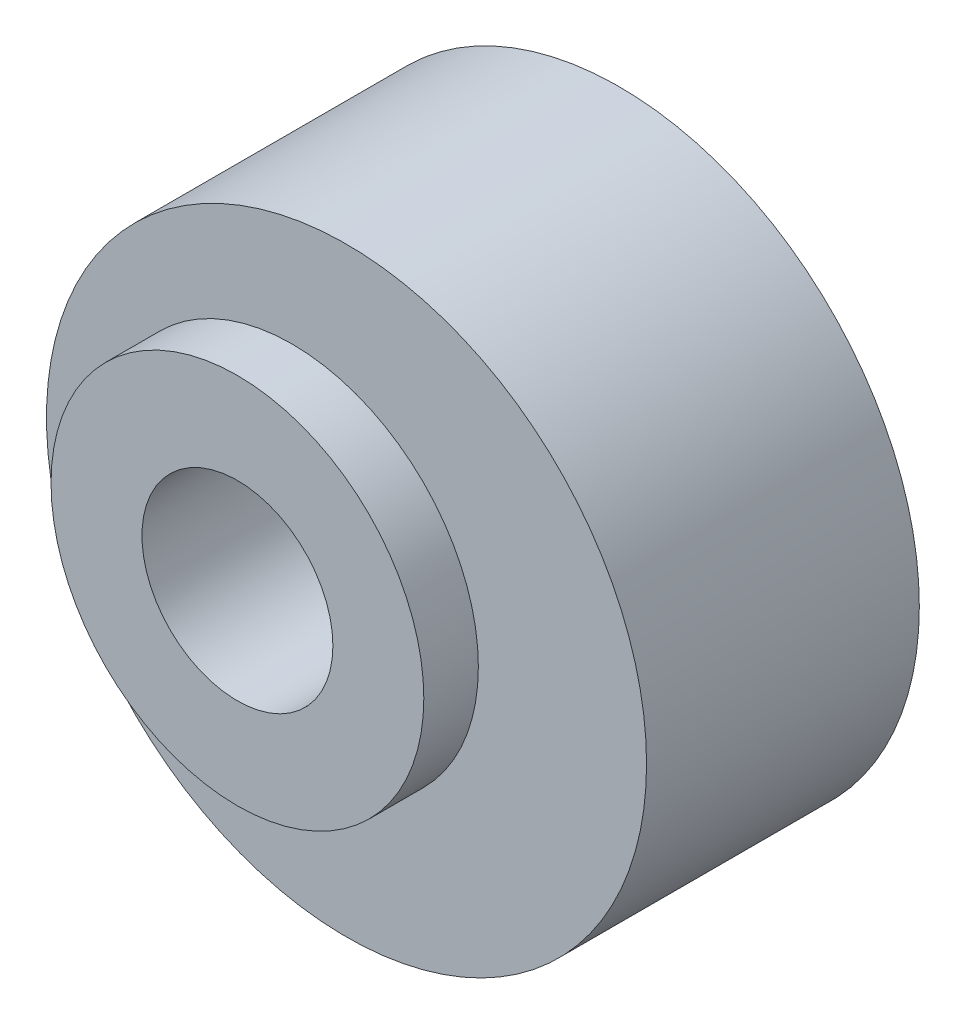
ISO-10303-21;
HEADER;
FILE_DESCRIPTION(('STEP AP214'),'2;1');
FILE_NAME('part.step','',(''),(''),'','','');
FILE_SCHEMA(('AUTOMOTIVE_DESIGN { 1 0 10303 214 1 1 1 1 }'));
ENDSEC;
DATA;
#1=APPLICATION_CONTEXT('core data for automotive mechanical design processes');
#2=APPLICATION_PROTOCOL_DEFINITION('international standard','automotive_design',2000,#1);
#3=PRODUCT_CONTEXT('',#1,'mechanical');
#4=PRODUCT('Part','Part','',(#3));
#5=PRODUCT_RELATED_PRODUCT_CATEGORY('part','',(#4));
#6=PRODUCT_DEFINITION_FORMATION('','',#4);
#7=PRODUCT_DEFINITION_CONTEXT('part definition',#1,'design');
#8=PRODUCT_DEFINITION('design','',#6,#7);
#9=PRODUCT_DEFINITION_SHAPE('','',#8);
#10=(LENGTH_UNIT() NAMED_UNIT(*) SI_UNIT(.MILLI.,.METRE.));
#11=(NAMED_UNIT(*) PLANE_ANGLE_UNIT() SI_UNIT($,.RADIAN.));
#12=(NAMED_UNIT(*) SI_UNIT($,.STERADIAN.) SOLID_ANGLE_UNIT());
#13=UNCERTAINTY_MEASURE_WITH_UNIT(LENGTH_MEASURE(1.E-05),#10,'distance_accuracy_value','');
#14=(GEOMETRIC_REPRESENTATION_CONTEXT(3) GLOBAL_UNCERTAINTY_ASSIGNED_CONTEXT((#13)) GLOBAL_UNIT_ASSIGNED_CONTEXT((#10,
#11,#12)) REPRESENTATION_CONTEXT('',''));
#15=CARTESIAN_POINT('',(0.,0.,0.));
#16=DIRECTION('',(0.,0.,1.));
#17=DIRECTION('',(1.,0.,0.));
#18=AXIS2_PLACEMENT_3D('',#15,#16,#17);
#19=CARTESIAN_POINT('',(-1.,0.,6.));
#20=DIRECTION('',(0.,0.,1.));
#21=DIRECTION('',(1.,0.,0.));
#22=AXIS2_PLACEMENT_3D('',#19,#20,#21);
#23=PLANE('',#22);
#24=CARTESIAN_POINT('',(-1.,0.,6.));
#25=DIRECTION('',(0.,0.,1.));
#26=DIRECTION('',(1.,0.,0.));
#27=AXIS2_PLACEMENT_3D('',#24,#25,#26);
#28=CIRCLE('',#27,1.75);
#29=CARTESIAN_POINT('',(0.75,0.,6.));
#30=VERTEX_POINT('',#29);
#31=EDGE_CURVE('E38',#30,#30,#28,.F.);
#32=ORIENTED_EDGE('',*,*,#31,.T.);
#33=EDGE_LOOP('',(#32));
#34=FACE_BOUND('',#33,.T.);
#35=CARTESIAN_POINT('',(-1.,0.,6.));
#36=DIRECTION('',(0.,0.,1.));
#37=DIRECTION('',(1.,0.,0.));
#38=AXIS2_PLACEMENT_3D('',#35,#36,#37);
#39=CIRCLE('',#38,3.41666666666667);
#40=CARTESIAN_POINT('',(2.41666666666667,0.,6.));
#41=VERTEX_POINT('',#40);
#42=EDGE_CURVE('E17',#41,#41,#39,.F.);
#43=ORIENTED_EDGE('',*,*,#42,.F.);
#44=EDGE_LOOP('',(#43));
#45=FACE_BOUND('',#44,.T.);
#46=ADVANCED_FACE('F14',(#34,#45),#23,.T.);
#47=CARTESIAN_POINT('',(-1.,0.,5.));
#48=DIRECTION('',(0.,0.,1.));
#49=DIRECTION('',(1.,0.,0.));
#50=AXIS2_PLACEMENT_3D('',#47,#48,#49);
#51=CYLINDRICAL_SURFACE('',#50,3.41666666666667);
#52=CARTESIAN_POINT('',(-1.,0.,5.));
#53=DIRECTION('',(0.,0.,1.));
#54=DIRECTION('',(1.,0.,0.));
#55=AXIS2_PLACEMENT_3D('',#52,#53,#54);
#56=CIRCLE('',#55,3.41666666666667);
#57=CARTESIAN_POINT('',(2.41666666666667,0.,5.));
#58=VERTEX_POINT('',#57);
#59=EDGE_CURVE('E35',#58,#58,#56,.F.);
#60=ORIENTED_EDGE('',*,*,#59,.F.);
#61=EDGE_LOOP('',(#60));
#62=FACE_BOUND('',#61,.T.);
#63=ORIENTED_EDGE('',*,*,#42,.T.);
#64=EDGE_LOOP('',(#63));
#65=FACE_BOUND('',#64,.T.);
#66=ADVANCED_FACE('F47',(#62,#65),#51,.T.);
#67=CARTESIAN_POINT('',(-1.,0.,5.));
#68=DIRECTION('',(0.,0.,1.));
#69=DIRECTION('',(1.,0.,0.));
#70=AXIS2_PLACEMENT_3D('',#67,#68,#69);
#71=CYLINDRICAL_SURFACE('',#70,1.75);
#72=ORIENTED_EDGE('',*,*,#31,.F.);
#73=EDGE_LOOP('',(#72));
#74=FACE_BOUND('',#73,.T.);
#75=CARTESIAN_POINT('',(-1.,0.,0.));
#76=DIRECTION('',(0.,0.,1.));
#77=DIRECTION('',(1.,0.,0.));
#78=AXIS2_PLACEMENT_3D('',#75,#76,#77);
#79=CIRCLE('',#78,1.75);
#80=CARTESIAN_POINT('',(0.75,0.,0.));
#81=VERTEX_POINT('',#80);
#82=EDGE_CURVE('E30',#81,#81,#79,.F.);
#83=ORIENTED_EDGE('',*,*,#82,.T.);
#84=EDGE_LOOP('',(#83));
#85=FACE_BOUND('',#84,.T.);
#86=ADVANCED_FACE('F54',(#74,#85),#71,.F.);
#87=CARTESIAN_POINT('',(0.,0.,5.));
#88=DIRECTION('',(0.,0.,1.));
#89=DIRECTION('',(1.,0.,0.));
#90=AXIS2_PLACEMENT_3D('',#87,#88,#89);
#91=PLANE('',#90);
#92=ORIENTED_EDGE('',*,*,#59,.T.);
#93=EDGE_LOOP('',(#92));
#94=FACE_BOUND('',#93,.T.);
#95=CARTESIAN_POINT('',(0.,0.,5.));
#96=DIRECTION('',(0.,0.,1.));
#97=DIRECTION('',(1.,0.,0.));
#98=AXIS2_PLACEMENT_3D('',#95,#96,#97);
#99=CIRCLE('',#98,5.5);
#100=CARTESIAN_POINT('',(5.5,0.,5.));
#101=VERTEX_POINT('',#100);
#102=EDGE_CURVE('E22',#101,#101,#99,.F.);
#103=ORIENTED_EDGE('',*,*,#102,.F.);
#104=EDGE_LOOP('',(#103));
#105=FACE_BOUND('',#104,.T.);
#106=ADVANCED_FACE('F63',(#94,#105),#91,.T.);
#107=CARTESIAN_POINT('',(0.,0.,0.));
#108=DIRECTION('',(0.,0.,1.));
#109=DIRECTION('',(1.,0.,0.));
#110=AXIS2_PLACEMENT_3D('',#107,#108,#109);
#111=PLANE('',#110);
#112=ORIENTED_EDGE('',*,*,#82,.F.);
#113=EDGE_LOOP('',(#112));
#114=FACE_BOUND('',#113,.T.);
#115=CARTESIAN_POINT('',(0.,0.,0.));
#116=DIRECTION('',(0.,0.,1.));
#117=DIRECTION('',(1.,0.,0.));
#118=AXIS2_PLACEMENT_3D('',#115,#116,#117);
#119=CIRCLE('',#118,5.5);
#120=CARTESIAN_POINT('',(5.5,0.,0.));
#121=VERTEX_POINT('',#120);
#122=EDGE_CURVE('E10',#121,#121,#119,.T.);
#123=ORIENTED_EDGE('',*,*,#122,.F.);
#124=EDGE_LOOP('',(#123));
#125=FACE_BOUND('',#124,.T.);
#126=ADVANCED_FACE('F58',(#114,#125),#111,.F.);
#127=CARTESIAN_POINT('',(0.,0.,0.));
#128=DIRECTION('',(0.,0.,1.));
#129=DIRECTION('',(1.,0.,0.));
#130=AXIS2_PLACEMENT_3D('',#127,#128,#129);
#131=CYLINDRICAL_SURFACE('',#130,5.5);
#132=ORIENTED_EDGE('',*,*,#122,.T.);
#133=EDGE_LOOP('',(#132));
#134=FACE_BOUND('',#133,.T.);
#135=ORIENTED_EDGE('',*,*,#102,.T.);
#136=EDGE_LOOP('',(#135));
#137=FACE_BOUND('',#136,.T.);
#138=ADVANCED_FACE('F56',(#134,#137),#131,.T.);
#139=CLOSED_SHELL('',(#46,#66,#86,#106,#126,#138));
#140=MANIFOLD_SOLID_BREP('B1',#139);
#141=ADVANCED_BREP_SHAPE_REPRESENTATION('',(#18,#140),#14);
#142=SHAPE_DEFINITION_REPRESENTATION(#9,#141);
ENDSEC;
END-ISO-10303-21;
